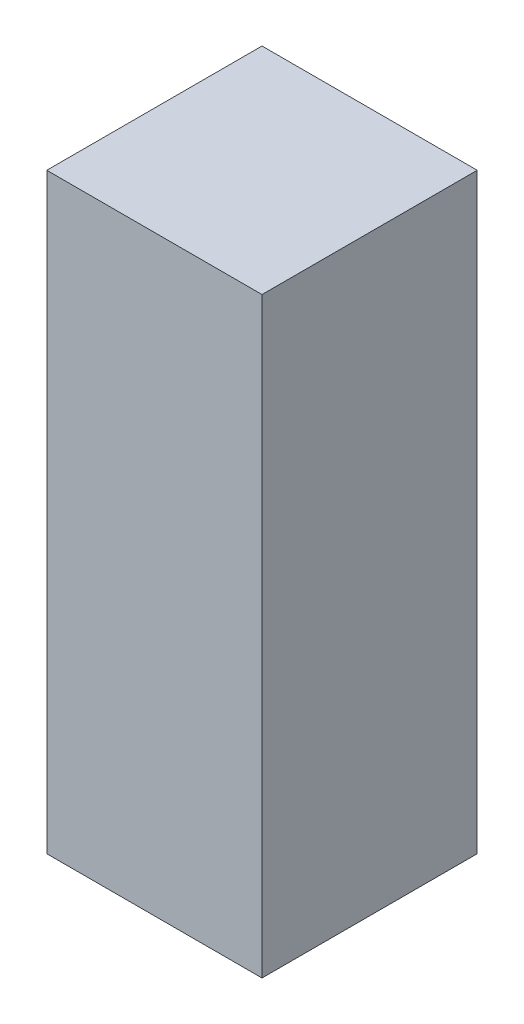
ISO-10303-21;
HEADER;
FILE_DESCRIPTION(('STEP AP214'),'2;1');
FILE_NAME('part.step','',(''),(''),'','','');
FILE_SCHEMA(('AUTOMOTIVE_DESIGN { 1 0 10303 214 1 1 1 1 }'));
ENDSEC;
DATA;
#1=APPLICATION_CONTEXT('core data for automotive mechanical design processes');
#2=APPLICATION_PROTOCOL_DEFINITION('international standard','automotive_design',2000,#1);
#3=PRODUCT_CONTEXT('',#1,'mechanical');
#4=PRODUCT('Part','Part','',(#3));
#5=PRODUCT_RELATED_PRODUCT_CATEGORY('part','',(#4));
#6=PRODUCT_DEFINITION_FORMATION('','',#4);
#7=PRODUCT_DEFINITION_CONTEXT('part definition',#1,'design');
#8=PRODUCT_DEFINITION('design','',#6,#7);
#9=PRODUCT_DEFINITION_SHAPE('','',#8);
#10=(LENGTH_UNIT() NAMED_UNIT(*) SI_UNIT(.MILLI.,.METRE.));
#11=(NAMED_UNIT(*) PLANE_ANGLE_UNIT() SI_UNIT($,.RADIAN.));
#12=(NAMED_UNIT(*) SI_UNIT($,.STERADIAN.) SOLID_ANGLE_UNIT());
#13=UNCERTAINTY_MEASURE_WITH_UNIT(LENGTH_MEASURE(1.E-05),#10,'distance_accuracy_value','');
#14=(GEOMETRIC_REPRESENTATION_CONTEXT(3) GLOBAL_UNCERTAINTY_ASSIGNED_CONTEXT((#13)) GLOBAL_UNIT_ASSIGNED_CONTEXT((#10,
#11,#12)) REPRESENTATION_CONTEXT('',''));
#15=CARTESIAN_POINT('',(0.,0.,0.));
#16=DIRECTION('',(0.,0.,1.));
#17=DIRECTION('',(1.,0.,0.));
#18=AXIS2_PLACEMENT_3D('',#15,#16,#17);
#19=CARTESIAN_POINT('',(20.,110.,-20.));
#20=DIRECTION('',(-1.,0.,0.));
#21=DIRECTION('',(0.,0.,1.));
#22=AXIS2_PLACEMENT_3D('',#19,#20,#21);
#23=PLANE('',#22);
#24=DIRECTION('',(0.,0.,-1.));
#25=VECTOR('',#24,1.);
#26=CARTESIAN_POINT('',(20.,0.,-20.));
#27=LINE('',#26,#25);
#28=CARTESIAN_POINT('',(20.,0.,20.));
#29=VERTEX_POINT('',#28);
#30=CARTESIAN_POINT('',(20.,0.,-20.));
#31=VERTEX_POINT('',#30);
#32=EDGE_CURVE('E96',#29,#31,#27,.T.);
#33=ORIENTED_EDGE('',*,*,#32,.T.);
#34=DIRECTION('',(0.,-1.,0.));
#35=VECTOR('',#34,1.);
#36=CARTESIAN_POINT('',(20.,110.,-20.));
#37=LINE('',#36,#35);
#38=CARTESIAN_POINT('',(20.,110.,-20.));
#39=VERTEX_POINT('',#38);
#40=EDGE_CURVE('E11',#39,#31,#37,.T.);
#41=ORIENTED_EDGE('',*,*,#40,.F.);
#42=DIRECTION('',(0.,0.,-1.));
#43=VECTOR('',#42,1.);
#44=CARTESIAN_POINT('',(20.,110.,-20.));
#45=LINE('',#44,#43);
#46=CARTESIAN_POINT('',(20.,110.,20.));
#47=VERTEX_POINT('',#46);
#48=EDGE_CURVE('E84',#47,#39,#45,.T.);
#49=ORIENTED_EDGE('',*,*,#48,.F.);
#50=DIRECTION('',(0.,-1.,0.));
#51=VECTOR('',#50,1.);
#52=CARTESIAN_POINT('',(20.,110.,20.));
#53=LINE('',#52,#51);
#54=EDGE_CURVE('E92',#47,#29,#53,.T.);
#55=ORIENTED_EDGE('',*,*,#54,.T.);
#56=EDGE_LOOP('',(#33,#41,#49,#55));
#57=FACE_BOUND('',#56,.T.);
#58=ADVANCED_FACE('F33',(#57),#23,.F.);
#59=CARTESIAN_POINT('',(-20.,110.,-20.));
#60=DIRECTION('',(0.,0.,1.));
#61=DIRECTION('',(1.,0.,0.));
#62=AXIS2_PLACEMENT_3D('',#59,#60,#61);
#63=PLANE('',#62);
#64=DIRECTION('',(-1.,0.,0.));
#65=VECTOR('',#64,1.);
#66=CARTESIAN_POINT('',(-20.,0.,-20.));
#67=LINE('',#66,#65);
#68=CARTESIAN_POINT('',(-20.,0.,-20.));
#69=VERTEX_POINT('',#68);
#70=EDGE_CURVE('E88',#31,#69,#67,.T.);
#71=ORIENTED_EDGE('',*,*,#70,.T.);
#72=DIRECTION('',(0.,-1.,0.));
#73=VECTOR('',#72,1.);
#74=CARTESIAN_POINT('',(-20.,110.,-20.));
#75=LINE('',#74,#73);
#76=CARTESIAN_POINT('',(-20.,110.,-20.));
#77=VERTEX_POINT('',#76);
#78=EDGE_CURVE('E41',#77,#69,#75,.T.);
#79=ORIENTED_EDGE('',*,*,#78,.F.);
#80=DIRECTION('',(-1.,0.,0.));
#81=VECTOR('',#80,1.);
#82=CARTESIAN_POINT('',(-20.,110.,-20.));
#83=LINE('',#82,#81);
#84=EDGE_CURVE('E79',#39,#77,#83,.T.);
#85=ORIENTED_EDGE('',*,*,#84,.F.);
#86=ORIENTED_EDGE('',*,*,#40,.T.);
#87=EDGE_LOOP('',(#71,#79,#85,#86));
#88=FACE_BOUND('',#87,.T.);
#89=ADVANCED_FACE('F87',(#88),#63,.F.);
#90=CARTESIAN_POINT('',(-20.,110.,-20.));
#91=DIRECTION('',(1.,0.,0.));
#92=DIRECTION('',(0.,0.,-1.));
#93=AXIS2_PLACEMENT_3D('',#90,#91,#92);
#94=PLANE('',#93);
#95=DIRECTION('',(0.,0.,1.));
#96=VECTOR('',#95,1.);
#97=CARTESIAN_POINT('',(-20.,0.,-20.));
#98=LINE('',#97,#96);
#99=CARTESIAN_POINT('',(-20.,0.,20.));
#100=VERTEX_POINT('',#99);
#101=EDGE_CURVE('E66',#69,#100,#98,.T.);
#102=ORIENTED_EDGE('',*,*,#101,.T.);
#103=DIRECTION('',(0.,-1.,0.));
#104=VECTOR('',#103,1.);
#105=CARTESIAN_POINT('',(-20.,110.,20.));
#106=LINE('',#105,#104);
#107=CARTESIAN_POINT('',(-20.,110.,20.));
#108=VERTEX_POINT('',#107);
#109=EDGE_CURVE('E89',#108,#100,#106,.T.);
#110=ORIENTED_EDGE('',*,*,#109,.F.);
#111=DIRECTION('',(0.,0.,1.));
#112=VECTOR('',#111,1.);
#113=CARTESIAN_POINT('',(-20.,110.,-20.));
#114=LINE('',#113,#112);
#115=EDGE_CURVE('E82',#77,#108,#114,.T.);
#116=ORIENTED_EDGE('',*,*,#115,.F.);
#117=ORIENTED_EDGE('',*,*,#78,.T.);
#118=EDGE_LOOP('',(#102,#110,#116,#117));
#119=FACE_BOUND('',#118,.T.);
#120=ADVANCED_FACE('F90',(#119),#94,.F.);
#121=CARTESIAN_POINT('',(-20.,110.,20.));
#122=DIRECTION('',(0.,0.,-1.));
#123=DIRECTION('',(-1.,0.,0.));
#124=AXIS2_PLACEMENT_3D('',#121,#122,#123);
#125=PLANE('',#124);
#126=DIRECTION('',(1.,0.,0.));
#127=VECTOR('',#126,1.);
#128=CARTESIAN_POINT('',(-20.,0.,20.));
#129=LINE('',#128,#127);
#130=EDGE_CURVE('E72',#100,#29,#129,.T.);
#131=ORIENTED_EDGE('',*,*,#130,.T.);
#132=ORIENTED_EDGE('',*,*,#54,.F.);
#133=DIRECTION('',(1.,0.,0.));
#134=VECTOR('',#133,1.);
#135=CARTESIAN_POINT('',(-20.,110.,20.));
#136=LINE('',#135,#134);
#137=EDGE_CURVE('E49',#108,#47,#136,.T.);
#138=ORIENTED_EDGE('',*,*,#137,.F.);
#139=ORIENTED_EDGE('',*,*,#109,.T.);
#140=EDGE_LOOP('',(#131,#132,#138,#139));
#141=FACE_BOUND('',#140,.T.);
#142=ADVANCED_FACE('F103',(#141),#125,.F.);
#143=CARTESIAN_POINT('',(0.,110.,0.));
#144=DIRECTION('',(0.,1.,0.));
#145=DIRECTION('',(0.,0.,1.));
#146=AXIS2_PLACEMENT_3D('',#143,#144,#145);
#147=PLANE('',#146);
#148=ORIENTED_EDGE('',*,*,#48,.T.);
#149=ORIENTED_EDGE('',*,*,#84,.T.);
#150=ORIENTED_EDGE('',*,*,#115,.T.);
#151=ORIENTED_EDGE('',*,*,#137,.T.);
#152=EDGE_LOOP('',(#148,#149,#150,#151));
#153=FACE_BOUND('',#152,.T.);
#154=ADVANCED_FACE('F80',(#153),#147,.T.);
#155=CARTESIAN_POINT('',(0.,0.,0.));
#156=DIRECTION('',(0.,1.,0.));
#157=DIRECTION('',(0.,0.,1.));
#158=AXIS2_PLACEMENT_3D('',#155,#156,#157);
#159=PLANE('',#158);
#160=ORIENTED_EDGE('',*,*,#32,.F.);
#161=ORIENTED_EDGE('',*,*,#130,.F.);
#162=ORIENTED_EDGE('',*,*,#101,.F.);
#163=ORIENTED_EDGE('',*,*,#70,.F.);
#164=EDGE_LOOP('',(#160,#161,#162,#163));
#165=FACE_BOUND('',#164,.T.);
#166=ADVANCED_FACE('F106',(#165),#159,.F.);
#167=CLOSED_SHELL('',(#58,#89,#120,#142,#154,#166));
#168=MANIFOLD_SOLID_BREP('B2',#167);
#169=ADVANCED_BREP_SHAPE_REPRESENTATION('',(#18,#168),#14);
#170=SHAPE_DEFINITION_REPRESENTATION(#9,#169);
ENDSEC;
END-ISO-10303-21;
